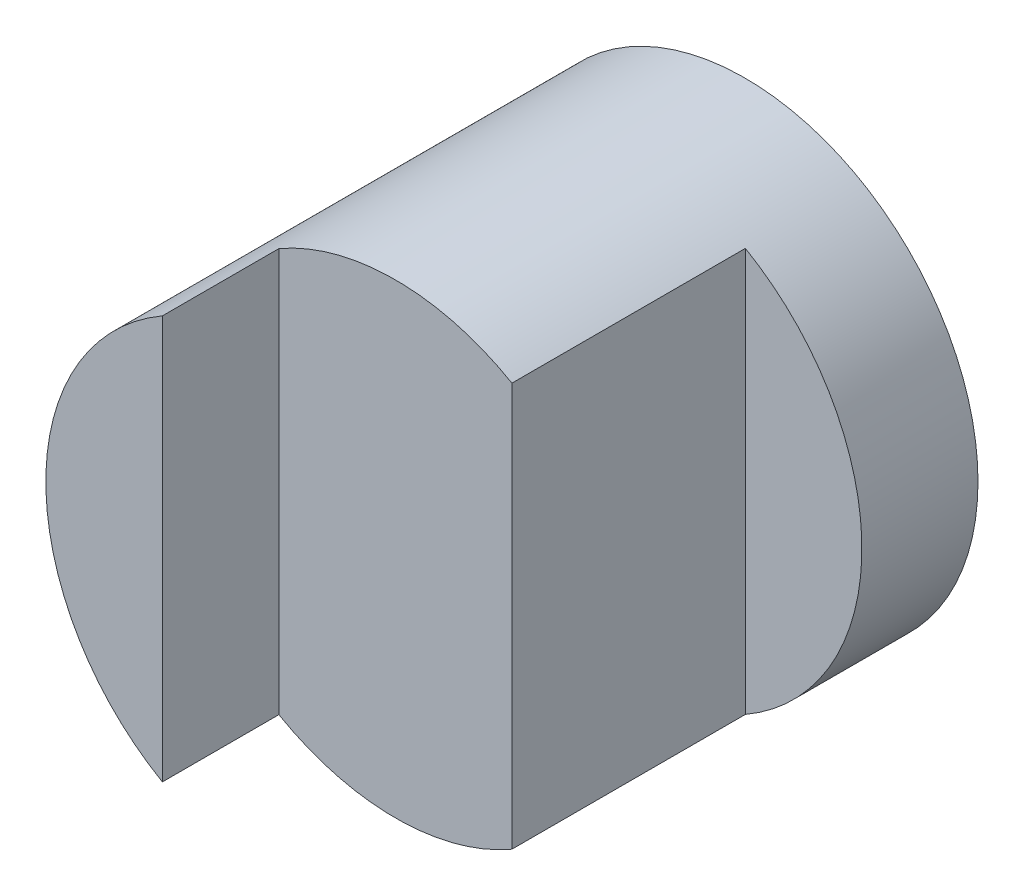
ISO-10303-21;
HEADER;
FILE_DESCRIPTION(('STEP AP214'),'2;1');
FILE_NAME('part.step','',(''),(''),'','','');
FILE_SCHEMA(('AUTOMOTIVE_DESIGN { 1 0 10303 214 1 1 1 1 }'));
ENDSEC;
DATA;
#1=APPLICATION_CONTEXT('core data for automotive mechanical design processes');
#2=APPLICATION_PROTOCOL_DEFINITION('international standard','automotive_design',2000,#1);
#3=PRODUCT_CONTEXT('',#1,'mechanical');
#4=PRODUCT('Part','Part','',(#3));
#5=PRODUCT_RELATED_PRODUCT_CATEGORY('part','',(#4));
#6=PRODUCT_DEFINITION_FORMATION('','',#4);
#7=PRODUCT_DEFINITION_CONTEXT('part definition',#1,'design');
#8=PRODUCT_DEFINITION('design','',#6,#7);
#9=PRODUCT_DEFINITION_SHAPE('','',#8);
#10=(LENGTH_UNIT() NAMED_UNIT(*) SI_UNIT(.MILLI.,.METRE.));
#11=(NAMED_UNIT(*) PLANE_ANGLE_UNIT() SI_UNIT($,.RADIAN.));
#12=(NAMED_UNIT(*) SI_UNIT($,.STERADIAN.) SOLID_ANGLE_UNIT());
#13=UNCERTAINTY_MEASURE_WITH_UNIT(LENGTH_MEASURE(1.E-05),#10,'distance_accuracy_value','');
#14=(GEOMETRIC_REPRESENTATION_CONTEXT(3) GLOBAL_UNCERTAINTY_ASSIGNED_CONTEXT((#13)) GLOBAL_UNIT_ASSIGNED_CONTEXT((#10,
#11,#12)) REPRESENTATION_CONTEXT('',''));
#15=CARTESIAN_POINT('',(0.,0.,0.));
#16=DIRECTION('',(0.,0.,1.));
#17=DIRECTION('',(1.,0.,0.));
#18=AXIS2_PLACEMENT_3D('',#15,#16,#17);
#19=CARTESIAN_POINT('',(0.,0.,4.));
#20=DIRECTION('',(0.,0.,-1.));
#21=DIRECTION('',(-1.,0.,0.));
#22=AXIS2_PLACEMENT_3D('',#19,#20,#21);
#23=CYLINDRICAL_SURFACE('',#22,2.);
#24=CARTESIAN_POINT('',(0.,0.,0.));
#25=DIRECTION('',(0.,0.,1.));
#26=DIRECTION('',(1.,0.,0.));
#27=AXIS2_PLACEMENT_3D('',#24,#25,#26);
#28=CIRCLE('',#27,2.);
#29=CARTESIAN_POINT('',(2.,0.,0.));
#30=VERTEX_POINT('',#29);
#31=EDGE_CURVE('E98',#30,#30,#28,.T.);
#32=ORIENTED_EDGE('',*,*,#31,.T.);
#33=EDGE_LOOP('',(#32));
#34=FACE_BOUND('',#33,.T.);
#35=CARTESIAN_POINT('',(0.,0.,4.));
#36=DIRECTION('',(0.,0.,1.));
#37=DIRECTION('',(1.,0.,0.));
#38=AXIS2_PLACEMENT_3D('',#35,#36,#37);
#39=CIRCLE('',#38,2.);
#40=CARTESIAN_POINT('',(-1.,1.73205080756888,4.));
#41=VERTEX_POINT('',#40);
#42=CARTESIAN_POINT('',(-1.,-1.73205080756888,4.));
#43=VERTEX_POINT('',#42);
#44=EDGE_CURVE('E97',#41,#43,#39,.T.);
#45=ORIENTED_EDGE('',*,*,#44,.F.);
#46=DIRECTION('',(0.,0.,-1.));
#47=VECTOR('',#46,1.);
#48=CARTESIAN_POINT('',(-1.,1.73205080756888,4.));
#49=LINE('',#48,#47);
#50=CARTESIAN_POINT('',(-1.,1.73205080756888,3.));
#51=VERTEX_POINT('',#50);
#52=EDGE_CURVE('E47',#41,#51,#49,.T.);
#53=ORIENTED_EDGE('',*,*,#52,.T.);
#54=CARTESIAN_POINT('',(0.,0.,3.));
#55=DIRECTION('',(0.,0.,-1.));
#56=DIRECTION('',(-1.,0.,0.));
#57=AXIS2_PLACEMENT_3D('',#54,#55,#56);
#58=CIRCLE('',#57,2.);
#59=CARTESIAN_POINT('',(1.,1.73205080756888,3.));
#60=VERTEX_POINT('',#59);
#61=EDGE_CURVE('E88',#51,#60,#58,.T.);
#62=ORIENTED_EDGE('',*,*,#61,.T.);
#63=DIRECTION('',(0.,0.,-1.));
#64=VECTOR('',#63,1.);
#65=CARTESIAN_POINT('',(1.,1.73205080756888,4.));
#66=LINE('',#65,#64);
#67=CARTESIAN_POINT('',(1.,1.73205080756888,0.996424706562642));
#68=VERTEX_POINT('',#67);
#69=EDGE_CURVE('E93',#60,#68,#66,.T.);
#70=ORIENTED_EDGE('',*,*,#69,.T.);
#71=CARTESIAN_POINT('',(0.,0.,0.996424706562642));
#72=DIRECTION('',(0.,0.,-1.));
#73=DIRECTION('',(-1.,0.,0.));
#74=AXIS2_PLACEMENT_3D('',#71,#72,#73);
#75=CIRCLE('',#74,2.);
#76=CARTESIAN_POINT('',(1.,-1.73205080756888,0.996424706562642));
#77=VERTEX_POINT('',#76);
#78=EDGE_CURVE('E54',#68,#77,#75,.T.);
#79=ORIENTED_EDGE('',*,*,#78,.T.);
#80=DIRECTION('',(0.,0.,-1.));
#81=VECTOR('',#80,1.);
#82=CARTESIAN_POINT('',(1.,-1.73205080756888,4.));
#83=LINE('',#82,#81);
#84=CARTESIAN_POINT('',(1.,-1.73205080756888,3.));
#85=VERTEX_POINT('',#84);
#86=EDGE_CURVE('E11',#77,#85,#83,.F.);
#87=ORIENTED_EDGE('',*,*,#86,.T.);
#88=CARTESIAN_POINT('',(-1.,-1.73205080756888,3.));
#89=VERTEX_POINT('',#88);
#90=EDGE_CURVE('E40',#85,#89,#58,.T.);
#91=ORIENTED_EDGE('',*,*,#90,.T.);
#92=DIRECTION('',(0.,0.,-1.));
#93=VECTOR('',#92,1.);
#94=CARTESIAN_POINT('',(-1.,-1.73205080756888,4.));
#95=LINE('',#94,#93);
#96=EDGE_CURVE('E72',#89,#43,#95,.F.);
#97=ORIENTED_EDGE('',*,*,#96,.T.);
#98=EDGE_LOOP('',(#45,#53,#62,#70,#79,#87,#91,#97));
#99=FACE_BOUND('',#98,.T.);
#100=ADVANCED_FACE('F33',(#34,#99),#23,.T.);
#101=CARTESIAN_POINT('',(0.,0.,4.));
#102=DIRECTION('',(0.,0.,1.));
#103=DIRECTION('',(1.,0.,0.));
#104=AXIS2_PLACEMENT_3D('',#101,#102,#103);
#105=PLANE('',#104);
#106=DIRECTION('',(0.,-1.,0.));
#107=VECTOR('',#106,1.);
#108=CARTESIAN_POINT('',(-1.,0.,4.));
#109=LINE('',#108,#107);
#110=EDGE_CURVE('E76',#41,#43,#109,.T.);
#111=ORIENTED_EDGE('',*,*,#110,.F.);
#112=ORIENTED_EDGE('',*,*,#44,.T.);
#113=EDGE_LOOP('',(#111,#112));
#114=FACE_BOUND('',#113,.T.);
#115=ADVANCED_FACE('F119',(#114),#105,.T.);
#116=CARTESIAN_POINT('',(0.,0.,0.));
#117=DIRECTION('',(0.,0.,1.));
#118=DIRECTION('',(1.,0.,0.));
#119=AXIS2_PLACEMENT_3D('',#116,#117,#118);
#120=PLANE('',#119);
#121=ORIENTED_EDGE('',*,*,#31,.F.);
#122=EDGE_LOOP('',(#121));
#123=FACE_BOUND('',#122,.T.);
#124=ADVANCED_FACE('F115',(#123),#120,.F.);
#125=CARTESIAN_POINT('',(1.,-2.,0.996424706562642));
#126=DIRECTION('',(-1.,0.,0.));
#127=DIRECTION('',(0.,0.,1.));
#128=AXIS2_PLACEMENT_3D('',#125,#126,#127);
#129=PLANE('',#128);
#130=DIRECTION('',(0.,1.,0.));
#131=VECTOR('',#130,1.);
#132=CARTESIAN_POINT('',(1.,-2.,3.));
#133=LINE('',#132,#131);
#134=EDGE_CURVE('E89',#85,#60,#133,.T.);
#135=ORIENTED_EDGE('',*,*,#134,.F.);
#136=ORIENTED_EDGE('',*,*,#86,.F.);
#137=DIRECTION('',(0.,1.,0.));
#138=VECTOR('',#137,1.);
#139=CARTESIAN_POINT('',(1.,-2.,0.996424706562642));
#140=LINE('',#139,#138);
#141=EDGE_CURVE('E81',#77,#68,#140,.T.);
#142=ORIENTED_EDGE('',*,*,#141,.T.);
#143=ORIENTED_EDGE('',*,*,#69,.F.);
#144=EDGE_LOOP('',(#135,#136,#142,#143));
#145=FACE_BOUND('',#144,.T.);
#146=ADVANCED_FACE('F106',(#145),#129,.F.);
#147=CARTESIAN_POINT('',(2.,-2.,0.996424706562642));
#148=DIRECTION('',(0.,0.,-1.));
#149=DIRECTION('',(-1.,0.,0.));
#150=AXIS2_PLACEMENT_3D('',#147,#148,#149);
#151=PLANE('',#150);
#152=ORIENTED_EDGE('',*,*,#141,.F.);
#153=ORIENTED_EDGE('',*,*,#78,.F.);
#154=EDGE_LOOP('',(#152,#153));
#155=FACE_BOUND('',#154,.T.);
#156=ADVANCED_FACE('F107',(#155),#151,.F.);
#157=CARTESIAN_POINT('',(-1.,-2.,3.));
#158=DIRECTION('',(0.,0.,-1.));
#159=DIRECTION('',(-1.,0.,0.));
#160=AXIS2_PLACEMENT_3D('',#157,#158,#159);
#161=PLANE('',#160);
#162=DIRECTION('',(0.,1.,0.));
#163=VECTOR('',#162,1.);
#164=CARTESIAN_POINT('',(-1.,-2.,3.));
#165=LINE('',#164,#163);
#166=EDGE_CURVE('E75',#89,#51,#165,.T.);
#167=ORIENTED_EDGE('',*,*,#166,.F.);
#168=ORIENTED_EDGE('',*,*,#90,.F.);
#169=ORIENTED_EDGE('',*,*,#134,.T.);
#170=ORIENTED_EDGE('',*,*,#61,.F.);
#171=EDGE_LOOP('',(#167,#168,#169,#170));
#172=FACE_BOUND('',#171,.T.);
#173=ADVANCED_FACE('F84',(#172),#161,.F.);
#174=CARTESIAN_POINT('',(-1.,-2.,3.));
#175=DIRECTION('',(-1.,0.,0.));
#176=DIRECTION('',(0.,0.,1.));
#177=AXIS2_PLACEMENT_3D('',#174,#175,#176);
#178=PLANE('',#177);
#179=ORIENTED_EDGE('',*,*,#110,.T.);
#180=ORIENTED_EDGE('',*,*,#96,.F.);
#181=ORIENTED_EDGE('',*,*,#166,.T.);
#182=ORIENTED_EDGE('',*,*,#52,.F.);
#183=EDGE_LOOP('',(#179,#180,#181,#182));
#184=FACE_BOUND('',#183,.T.);
#185=ADVANCED_FACE('F74',(#184),#178,.F.);
#186=CLOSED_SHELL('',(#100,#115,#124,#146,#156,#173,#185));
#187=MANIFOLD_SOLID_BREP('B2',#186);
#188=ADVANCED_BREP_SHAPE_REPRESENTATION('',(#18,#187),#14);
#189=SHAPE_DEFINITION_REPRESENTATION(#9,#188);
ENDSEC;
END-ISO-10303-21;
